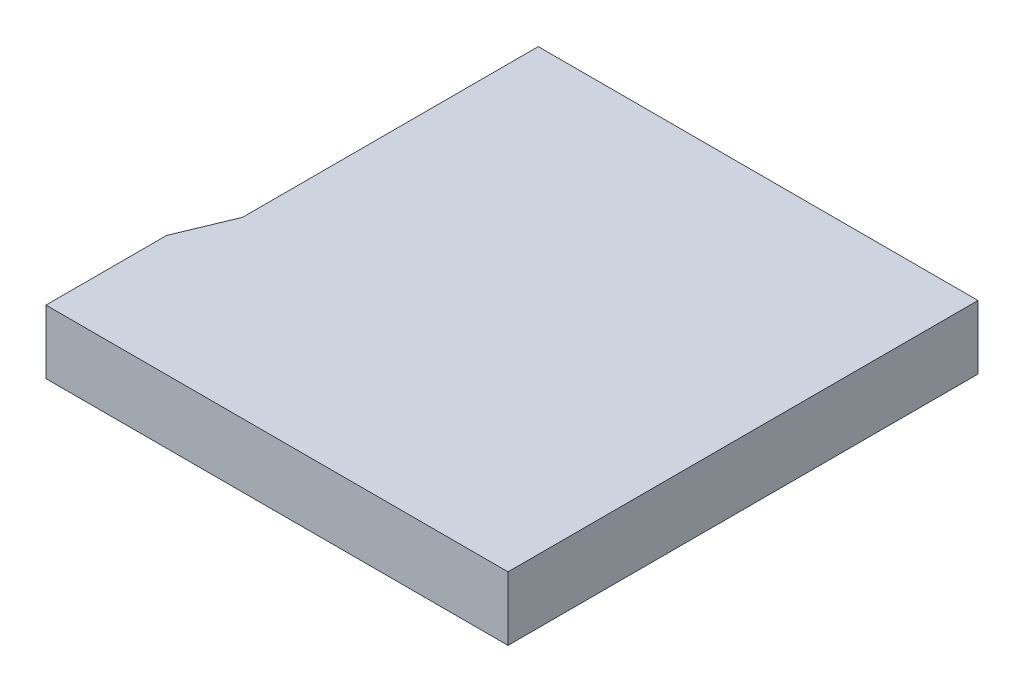
ISO-10303-21;
HEADER;
FILE_DESCRIPTION(('STEP AP214'),'2;1');
FILE_NAME('part.step','',(''),(''),'','','');
FILE_SCHEMA(('AUTOMOTIVE_DESIGN { 1 0 10303 214 1 1 1 1 }'));
ENDSEC;
DATA;
#1=APPLICATION_CONTEXT('core data for automotive mechanical design processes');
#2=APPLICATION_PROTOCOL_DEFINITION('international standard','automotive_design',2000,#1);
#3=PRODUCT_CONTEXT('',#1,'mechanical');
#4=PRODUCT('Part','Part','',(#3));
#5=PRODUCT_RELATED_PRODUCT_CATEGORY('part','',(#4));
#6=PRODUCT_DEFINITION_FORMATION('','',#4);
#7=PRODUCT_DEFINITION_CONTEXT('part definition',#1,'design');
#8=PRODUCT_DEFINITION('design','',#6,#7);
#9=PRODUCT_DEFINITION_SHAPE('','',#8);
#10=(LENGTH_UNIT() NAMED_UNIT(*) SI_UNIT(.MILLI.,.METRE.));
#11=(NAMED_UNIT(*) PLANE_ANGLE_UNIT() SI_UNIT($,.RADIAN.));
#12=(NAMED_UNIT(*) SI_UNIT($,.STERADIAN.) SOLID_ANGLE_UNIT());
#13=UNCERTAINTY_MEASURE_WITH_UNIT(LENGTH_MEASURE(1.E-05),#10,'distance_accuracy_value','');
#14=(GEOMETRIC_REPRESENTATION_CONTEXT(3) GLOBAL_UNCERTAINTY_ASSIGNED_CONTEXT((#13)) GLOBAL_UNIT_ASSIGNED_CONTEXT((#10,
#11,#12)) REPRESENTATION_CONTEXT('',''));
#15=CARTESIAN_POINT('',(0.,0.,0.));
#16=DIRECTION('',(0.,0.,1.));
#17=DIRECTION('',(1.,0.,0.));
#18=AXIS2_PLACEMENT_3D('',#15,#16,#17);
#19=CARTESIAN_POINT('',(0.,2.,-3.78665682258882));
#20=DIRECTION('',(1.,0.,0.));
#21=DIRECTION('',(0.,0.,-1.));
#22=AXIS2_PLACEMENT_3D('',#19,#20,#21);
#23=PLANE('',#22);
#24=DIRECTION('',(0.,0.,1.));
#25=VECTOR('',#24,1.);
#26=CARTESIAN_POINT('',(0.,0.,-3.78665682258882));
#27=LINE('',#26,#25);
#28=CARTESIAN_POINT('',(0.,0.,-3.78665682258882));
#29=VERTEX_POINT('',#28);
#30=CARTESIAN_POINT('',(0.,0.,0.));
#31=VERTEX_POINT('',#30);
#32=EDGE_CURVE('E117',#29,#31,#27,.T.);
#33=ORIENTED_EDGE('',*,*,#32,.T.);
#34=DIRECTION('',(0.,-1.,0.));
#35=VECTOR('',#34,1.);
#36=CARTESIAN_POINT('',(0.,2.,0.));
#37=LINE('',#36,#35);
#38=CARTESIAN_POINT('',(0.,2.,0.));
#39=VERTEX_POINT('',#38);
#40=EDGE_CURVE('E11',#39,#31,#37,.T.);
#41=ORIENTED_EDGE('',*,*,#40,.F.);
#42=DIRECTION('',(0.,0.,1.));
#43=VECTOR('',#42,1.);
#44=CARTESIAN_POINT('',(0.,2.,-3.78665682258882));
#45=LINE('',#44,#43);
#46=CARTESIAN_POINT('',(0.,2.,-3.78665682258882));
#47=VERTEX_POINT('',#46);
#48=EDGE_CURVE('E127',#47,#39,#45,.T.);
#49=ORIENTED_EDGE('',*,*,#48,.F.);
#50=DIRECTION('',(0.,-1.,0.));
#51=VECTOR('',#50,1.);
#52=CARTESIAN_POINT('',(0.,2.,-3.78665682258882));
#53=LINE('',#52,#51);
#54=EDGE_CURVE('E113',#47,#29,#53,.T.);
#55=ORIENTED_EDGE('',*,*,#54,.T.);
#56=EDGE_LOOP('',(#33,#41,#49,#55));
#57=FACE_BOUND('',#56,.T.);
#58=ADVANCED_FACE('F33',(#57),#23,.F.);
#59=CARTESIAN_POINT('',(0.,2.,0.));
#60=DIRECTION('',(0.,0.,-1.));
#61=DIRECTION('',(-1.,0.,0.));
#62=AXIS2_PLACEMENT_3D('',#59,#60,#61);
#63=PLANE('',#62);
#64=DIRECTION('',(1.,0.,0.));
#65=VECTOR('',#64,1.);
#66=CARTESIAN_POINT('',(0.,0.,0.));
#67=LINE('',#66,#65);
#68=CARTESIAN_POINT('',(14.5,0.,0.));
#69=VERTEX_POINT('',#68);
#70=EDGE_CURVE('E120',#31,#69,#67,.T.);
#71=ORIENTED_EDGE('',*,*,#70,.T.);
#72=DIRECTION('',(0.,-1.,0.));
#73=VECTOR('',#72,1.);
#74=CARTESIAN_POINT('',(14.5,2.,0.));
#75=LINE('',#74,#73);
#76=CARTESIAN_POINT('',(14.5,2.,0.));
#77=VERTEX_POINT('',#76);
#78=EDGE_CURVE('E41',#77,#69,#75,.T.);
#79=ORIENTED_EDGE('',*,*,#78,.F.);
#80=DIRECTION('',(1.,0.,0.));
#81=VECTOR('',#80,1.);
#82=CARTESIAN_POINT('',(0.,2.,0.));
#83=LINE('',#82,#81);
#84=EDGE_CURVE('E86',#39,#77,#83,.T.);
#85=ORIENTED_EDGE('',*,*,#84,.F.);
#86=ORIENTED_EDGE('',*,*,#40,.T.);
#87=EDGE_LOOP('',(#71,#79,#85,#86));
#88=FACE_BOUND('',#87,.T.);
#89=ADVANCED_FACE('F151',(#88),#63,.F.);
#90=CARTESIAN_POINT('',(14.5,2.,0.));
#91=DIRECTION('',(-1.,0.,0.));
#92=DIRECTION('',(0.,0.,1.));
#93=AXIS2_PLACEMENT_3D('',#90,#91,#92);
#94=PLANE('',#93);
#95=DIRECTION('',(0.,0.,-1.));
#96=VECTOR('',#95,1.);
#97=CARTESIAN_POINT('',(14.5,0.,0.));
#98=LINE('',#97,#96);
#99=CARTESIAN_POINT('',(14.5,0.,-14.75));
#100=VERTEX_POINT('',#99);
#101=EDGE_CURVE('E122',#69,#100,#98,.T.);
#102=ORIENTED_EDGE('',*,*,#101,.T.);
#103=DIRECTION('',(0.,-1.,0.));
#104=VECTOR('',#103,1.);
#105=CARTESIAN_POINT('',(14.5,2.,-14.75));
#106=LINE('',#105,#104);
#107=CARTESIAN_POINT('',(14.5,2.,-14.75));
#108=VERTEX_POINT('',#107);
#109=EDGE_CURVE('E108',#108,#100,#106,.T.);
#110=ORIENTED_EDGE('',*,*,#109,.F.);
#111=DIRECTION('',(0.,0.,-1.));
#112=VECTOR('',#111,1.);
#113=CARTESIAN_POINT('',(14.5,2.,0.));
#114=LINE('',#113,#112);
#115=EDGE_CURVE('E99',#77,#108,#114,.T.);
#116=ORIENTED_EDGE('',*,*,#115,.F.);
#117=ORIENTED_EDGE('',*,*,#78,.T.);
#118=EDGE_LOOP('',(#102,#110,#116,#117));
#119=FACE_BOUND('',#118,.T.);
#120=ADVANCED_FACE('F133',(#119),#94,.F.);
#121=CARTESIAN_POINT('',(14.5,2.,-14.75));
#122=DIRECTION('',(0.,0.,1.));
#123=DIRECTION('',(1.,0.,0.));
#124=AXIS2_PLACEMENT_3D('',#121,#122,#123);
#125=PLANE('',#124);
#126=DIRECTION('',(-1.,0.,0.));
#127=VECTOR('',#126,1.);
#128=CARTESIAN_POINT('',(14.5,0.,-14.75));
#129=LINE('',#128,#127);
#130=CARTESIAN_POINT('',(0.699265745725248,0.,-14.75));
#131=VERTEX_POINT('',#130);
#132=EDGE_CURVE('E107',#100,#131,#129,.T.);
#133=ORIENTED_EDGE('',*,*,#132,.T.);
#134=DIRECTION('',(0.,-1.,0.));
#135=VECTOR('',#134,1.);
#136=CARTESIAN_POINT('',(0.699265745725248,2.,-14.75));
#137=LINE('',#136,#135);
#138=CARTESIAN_POINT('',(0.699265745725248,2.,-14.75));
#139=VERTEX_POINT('',#138);
#140=EDGE_CURVE('E104',#139,#131,#137,.T.);
#141=ORIENTED_EDGE('',*,*,#140,.F.);
#142=DIRECTION('',(-1.,0.,0.));
#143=VECTOR('',#142,1.);
#144=CARTESIAN_POINT('',(14.5,2.,-14.75));
#145=LINE('',#144,#143);
#146=EDGE_CURVE('E93',#108,#139,#145,.T.);
#147=ORIENTED_EDGE('',*,*,#146,.F.);
#148=ORIENTED_EDGE('',*,*,#109,.T.);
#149=EDGE_LOOP('',(#133,#141,#147,#148));
#150=FACE_BOUND('',#149,.T.);
#151=ADVANCED_FACE('F105',(#150),#125,.F.);
#152=CARTESIAN_POINT('',(0.699265745725248,2.,-14.75));
#153=DIRECTION('',(1.,0.,0.));
#154=DIRECTION('',(0.,0.,-1.));
#155=AXIS2_PLACEMENT_3D('',#152,#153,#154);
#156=PLANE('',#155);
#157=DIRECTION('',(0.,0.,1.));
#158=VECTOR('',#157,1.);
#159=CARTESIAN_POINT('',(0.699265745725248,0.,-14.75));
#160=LINE('',#159,#158);
#161=CARTESIAN_POINT('',(0.699265745725249,0.,-5.47106805791811));
#162=VERTEX_POINT('',#161);
#163=EDGE_CURVE('E72',#131,#162,#160,.T.);
#164=ORIENTED_EDGE('',*,*,#163,.T.);
#165=DIRECTION('',(0.,-1.,0.));
#166=VECTOR('',#165,1.);
#167=CARTESIAN_POINT('',(0.699265745725249,2.,-5.47106805791811));
#168=LINE('',#167,#166);
#169=CARTESIAN_POINT('',(0.699265745725249,2.,-5.47106805791811));
#170=VERTEX_POINT('',#169);
#171=EDGE_CURVE('E109',#170,#162,#168,.T.);
#172=ORIENTED_EDGE('',*,*,#171,.F.);
#173=DIRECTION('',(0.,0.,1.));
#174=VECTOR('',#173,1.);
#175=CARTESIAN_POINT('',(0.699265745725248,2.,-14.75));
#176=LINE('',#175,#174);
#177=EDGE_CURVE('E97',#139,#170,#176,.T.);
#178=ORIENTED_EDGE('',*,*,#177,.F.);
#179=ORIENTED_EDGE('',*,*,#140,.T.);
#180=EDGE_LOOP('',(#164,#172,#178,#179));
#181=FACE_BOUND('',#180,.T.);
#182=ADVANCED_FACE('F111',(#181),#156,.F.);
#183=CARTESIAN_POINT('',(0.699265745725249,2.,-5.47106805791811));
#184=DIRECTION('',(0.923576873368328,0.,0.383413300472459));
#185=DIRECTION('',(0.383413300472459,0.,-0.923576873368328));
#186=AXIS2_PLACEMENT_3D('',#183,#184,#185);
#187=PLANE('',#186);
#188=DIRECTION('',(-0.383413300472459,0.,0.923576873368328));
#189=VECTOR('',#188,1.);
#190=CARTESIAN_POINT('',(0.699265745725249,0.,-5.47106805791811));
#191=LINE('',#190,#189);
#192=EDGE_CURVE('E78',#162,#29,#191,.T.);
#193=ORIENTED_EDGE('',*,*,#192,.T.);
#194=ORIENTED_EDGE('',*,*,#54,.F.);
#195=DIRECTION('',(-0.383413300472459,0.,0.923576873368328));
#196=VECTOR('',#195,1.);
#197=CARTESIAN_POINT('',(0.699265745725249,2.,-5.47106805791811));
#198=LINE('',#197,#196);
#199=EDGE_CURVE('E49',#170,#47,#198,.T.);
#200=ORIENTED_EDGE('',*,*,#199,.F.);
#201=ORIENTED_EDGE('',*,*,#171,.T.);
#202=EDGE_LOOP('',(#193,#194,#200,#201));
#203=FACE_BOUND('',#202,.T.);
#204=ADVANCED_FACE('F140',(#203),#187,.F.);
#205=CARTESIAN_POINT('',(0.,2.,0.));
#206=DIRECTION('',(0.,1.,0.));
#207=DIRECTION('',(0.,0.,1.));
#208=AXIS2_PLACEMENT_3D('',#205,#206,#207);
#209=PLANE('',#208);
#210=ORIENTED_EDGE('',*,*,#48,.T.);
#211=ORIENTED_EDGE('',*,*,#84,.T.);
#212=ORIENTED_EDGE('',*,*,#115,.T.);
#213=ORIENTED_EDGE('',*,*,#146,.T.);
#214=ORIENTED_EDGE('',*,*,#177,.T.);
#215=ORIENTED_EDGE('',*,*,#199,.T.);
#216=EDGE_LOOP('',(#210,#211,#212,#213,#214,#215));
#217=FACE_BOUND('',#216,.T.);
#218=ADVANCED_FACE('F95',(#217),#209,.T.);
#219=CARTESIAN_POINT('',(0.,0.,0.));
#220=DIRECTION('',(0.,1.,0.));
#221=DIRECTION('',(0.,0.,1.));
#222=AXIS2_PLACEMENT_3D('',#219,#220,#221);
#223=PLANE('',#222);
#224=ORIENTED_EDGE('',*,*,#32,.F.);
#225=ORIENTED_EDGE('',*,*,#192,.F.);
#226=ORIENTED_EDGE('',*,*,#163,.F.);
#227=ORIENTED_EDGE('',*,*,#132,.F.);
#228=ORIENTED_EDGE('',*,*,#101,.F.);
#229=ORIENTED_EDGE('',*,*,#70,.F.);
#230=EDGE_LOOP('',(#224,#225,#226,#227,#228,#229));
#231=FACE_BOUND('',#230,.T.);
#232=ADVANCED_FACE('F136',(#231),#223,.F.);
#233=CLOSED_SHELL('',(#58,#89,#120,#151,#182,#204,#218,#232));
#234=MANIFOLD_SOLID_BREP('B2',#233);
#235=ADVANCED_BREP_SHAPE_REPRESENTATION('',(#18,#234),#14);
#236=SHAPE_DEFINITION_REPRESENTATION(#9,#235);
ENDSEC;
END-ISO-10303-21;
